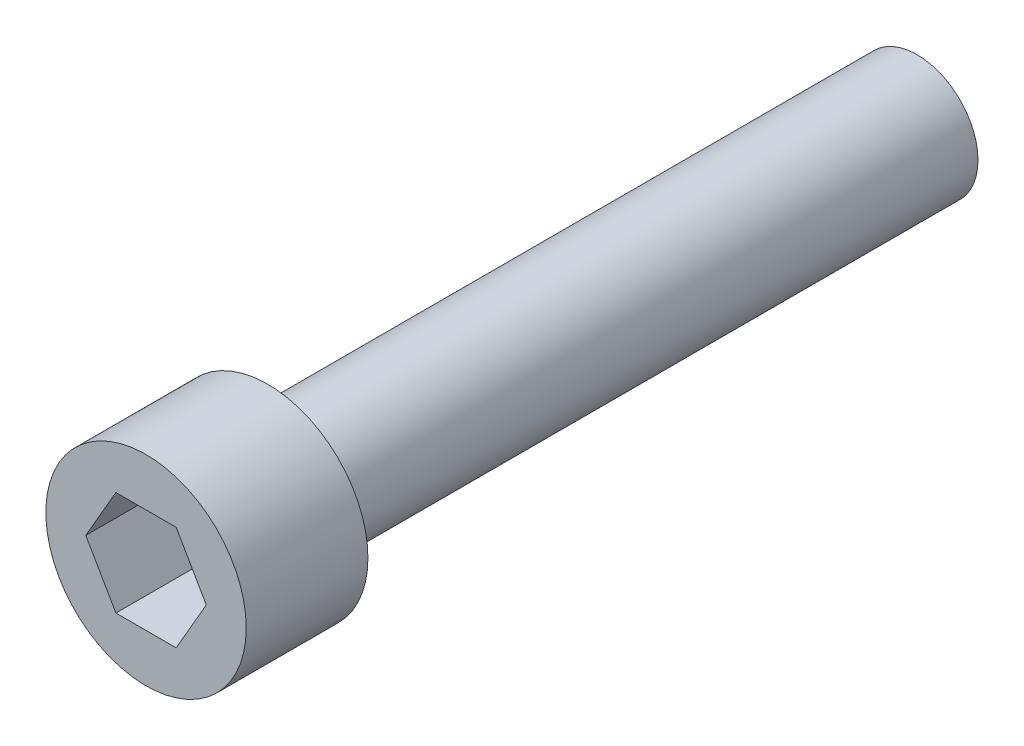
ISO-10303-21;
HEADER;
FILE_DESCRIPTION(('STEP AP214'),'2;1');
FILE_NAME('part.step','',(''),(''),'','','');
FILE_SCHEMA(('AUTOMOTIVE_DESIGN { 1 0 10303 214 1 1 1 1 }'));
ENDSEC;
DATA;
#1=APPLICATION_CONTEXT('core data for automotive mechanical design processes');
#2=APPLICATION_PROTOCOL_DEFINITION('international standard','automotive_design',2000,#1);
#3=PRODUCT_CONTEXT('',#1,'mechanical');
#4=PRODUCT('Part','Part','',(#3));
#5=PRODUCT_RELATED_PRODUCT_CATEGORY('part','',(#4));
#6=PRODUCT_DEFINITION_FORMATION('','',#4);
#7=PRODUCT_DEFINITION_CONTEXT('part definition',#1,'design');
#8=PRODUCT_DEFINITION('design','',#6,#7);
#9=PRODUCT_DEFINITION_SHAPE('','',#8);
#10=(LENGTH_UNIT() NAMED_UNIT(*) SI_UNIT(.MILLI.,.METRE.));
#11=(NAMED_UNIT(*) PLANE_ANGLE_UNIT() SI_UNIT($,.RADIAN.));
#12=(NAMED_UNIT(*) SI_UNIT($,.STERADIAN.) SOLID_ANGLE_UNIT());
#13=UNCERTAINTY_MEASURE_WITH_UNIT(LENGTH_MEASURE(1.E-05),#10,'distance_accuracy_value','');
#14=(GEOMETRIC_REPRESENTATION_CONTEXT(3) GLOBAL_UNCERTAINTY_ASSIGNED_CONTEXT((#13)) GLOBAL_UNIT_ASSIGNED_CONTEXT((#10,
#11,#12)) REPRESENTATION_CONTEXT('',''));
#15=CARTESIAN_POINT('',(0.,0.,0.));
#16=DIRECTION('',(0.,0.,1.));
#17=DIRECTION('',(1.,0.,0.));
#18=AXIS2_PLACEMENT_3D('',#15,#16,#17);
#19=CARTESIAN_POINT('',(3.42900000000001,0.,0.));
#20=DIRECTION('',(0.,0.,1.));
#21=DIRECTION('',(1.,0.,0.));
#22=AXIS2_PLACEMENT_3D('',#19,#20,#21);
#23=PLANE('',#22);
#24=DIRECTION('',(0.5,0.866025403784439,0.));
#25=VECTOR('',#24,1.);
#26=CARTESIAN_POINT('',(1.03111149638085,-1.7859375,0.));
#27=LINE('',#26,#25);
#28=CARTESIAN_POINT('',(1.03111149638085,-1.7859375,0.));
#29=VERTEX_POINT('',#28);
#30=CARTESIAN_POINT('',(2.06222299276169,0.,0.));
#31=VERTEX_POINT('',#30);
#32=EDGE_CURVE('E46',#29,#31,#27,.T.);
#33=ORIENTED_EDGE('',*,*,#32,.F.);
#34=DIRECTION('',(1.,0.,0.));
#35=VECTOR('',#34,1.);
#36=CARTESIAN_POINT('',(-1.03111149638085,-1.7859375,0.));
#37=LINE('',#36,#35);
#38=CARTESIAN_POINT('',(-1.03111149638085,-1.7859375,0.));
#39=VERTEX_POINT('',#38);
#40=EDGE_CURVE('E129',#39,#29,#37,.T.);
#41=ORIENTED_EDGE('',*,*,#40,.F.);
#42=DIRECTION('',(0.5,-0.866025403784439,0.));
#43=VECTOR('',#42,1.);
#44=CARTESIAN_POINT('',(-2.06222299276169,0.,0.));
#45=LINE('',#44,#43);
#46=CARTESIAN_POINT('',(-2.06222299276169,0.,0.));
#47=VERTEX_POINT('',#46);
#48=EDGE_CURVE('E127',#47,#39,#45,.T.);
#49=ORIENTED_EDGE('',*,*,#48,.F.);
#50=DIRECTION('',(-0.5,-0.866025403784439,0.));
#51=VECTOR('',#50,1.);
#52=CARTESIAN_POINT('',(-1.03111149638085,1.7859375,0.));
#53=LINE('',#52,#51);
#54=CARTESIAN_POINT('',(-1.03111149638085,1.7859375,0.));
#55=VERTEX_POINT('',#54);
#56=EDGE_CURVE('E94',#55,#47,#53,.T.);
#57=ORIENTED_EDGE('',*,*,#56,.F.);
#58=DIRECTION('',(-1.,0.,0.));
#59=VECTOR('',#58,1.);
#60=CARTESIAN_POINT('',(1.03111149638085,1.7859375,0.));
#61=LINE('',#60,#59);
#62=CARTESIAN_POINT('',(1.03111149638085,1.7859375,0.));
#63=VERTEX_POINT('',#62);
#64=EDGE_CURVE('E123',#63,#55,#61,.T.);
#65=ORIENTED_EDGE('',*,*,#64,.F.);
#66=DIRECTION('',(-0.5,0.866025403784438,0.));
#67=VECTOR('',#66,1.);
#68=CARTESIAN_POINT('',(2.06222299276169,0.,0.));
#69=LINE('',#68,#67);
#70=EDGE_CURVE('E120',#31,#63,#69,.T.);
#71=ORIENTED_EDGE('',*,*,#70,.F.);
#72=EDGE_LOOP('',(#33,#41,#49,#57,#65,#71));
#73=FACE_BOUND('',#72,.T.);
#74=CARTESIAN_POINT('',(0.,0.,0.));
#75=DIRECTION('',(0.,0.,1.));
#76=DIRECTION('',(1.,0.,0.));
#77=AXIS2_PLACEMENT_3D('',#74,#75,#76);
#78=CIRCLE('',#77,3.42900000000001);
#79=CARTESIAN_POINT('',(3.42900000000001,0.,0.));
#80=VERTEX_POINT('',#79);
#81=EDGE_CURVE('E133',#80,#80,#78,.T.);
#82=ORIENTED_EDGE('',*,*,#81,.T.);
#83=EDGE_LOOP('',(#82));
#84=FACE_BOUND('',#83,.T.);
#85=ADVANCED_FACE('F32',(#73,#84),#23,.T.);
#86=CARTESIAN_POINT('',(0.,0.,-26.3906));
#87=DIRECTION('',(0.,0.,-1.));
#88=DIRECTION('',(-1.,0.,0.));
#89=AXIS2_PLACEMENT_3D('',#86,#87,#88);
#90=PLANE('',#89);
#91=CARTESIAN_POINT('',(0.,0.,-26.3906));
#92=DIRECTION('',(0.,0.,1.));
#93=DIRECTION('',(1.,0.,0.));
#94=AXIS2_PLACEMENT_3D('',#91,#92,#93);
#95=CIRCLE('',#94,2.0828);
#96=CARTESIAN_POINT('',(2.08280000000001,0.,-26.3906));
#97=VERTEX_POINT('',#96);
#98=EDGE_CURVE('E11',#97,#97,#95,.T.);
#99=ORIENTED_EDGE('',*,*,#98,.F.);
#100=EDGE_LOOP('',(#99));
#101=FACE_BOUND('',#100,.T.);
#102=ADVANCED_FACE('F151',(#101),#90,.T.);
#103=CARTESIAN_POINT('',(0.,0.,0.));
#104=DIRECTION('',(0.,0.,1.));
#105=DIRECTION('',(1.,0.,0.));
#106=AXIS2_PLACEMENT_3D('',#103,#104,#105);
#107=CYLINDRICAL_SURFACE('',#106,2.0828);
#108=ORIENTED_EDGE('',*,*,#98,.T.);
#109=EDGE_LOOP('',(#108));
#110=FACE_BOUND('',#109,.T.);
#111=CARTESIAN_POINT('',(0.,0.,-4.1656));
#112=DIRECTION('',(0.,0.,1.));
#113=DIRECTION('',(1.,0.,0.));
#114=AXIS2_PLACEMENT_3D('',#111,#112,#113);
#115=CIRCLE('',#114,2.08280000000001);
#116=CARTESIAN_POINT('',(2.08280000000001,0.,-4.1656));
#117=VERTEX_POINT('',#116);
#118=EDGE_CURVE('E39',#117,#117,#115,.T.);
#119=ORIENTED_EDGE('',*,*,#118,.F.);
#120=EDGE_LOOP('',(#119));
#121=FACE_BOUND('',#120,.T.);
#122=ADVANCED_FACE('F149',(#110,#121),#107,.T.);
#123=CARTESIAN_POINT('',(2.08280000000001,0.,-4.1656));
#124=DIRECTION('',(0.,0.,-1.));
#125=DIRECTION('',(-1.,0.,0.));
#126=AXIS2_PLACEMENT_3D('',#123,#124,#125);
#127=PLANE('',#126);
#128=ORIENTED_EDGE('',*,*,#118,.T.);
#129=EDGE_LOOP('',(#128));
#130=FACE_BOUND('',#129,.T.);
#131=CARTESIAN_POINT('',(0.,0.,-4.1656));
#132=DIRECTION('',(0.,0.,1.));
#133=DIRECTION('',(1.,0.,0.));
#134=AXIS2_PLACEMENT_3D('',#131,#132,#133);
#135=CIRCLE('',#134,3.429);
#136=CARTESIAN_POINT('',(3.429,0.,-4.1656));
#137=VERTEX_POINT('',#136);
#138=EDGE_CURVE('E141',#137,#137,#135,.T.);
#139=ORIENTED_EDGE('',*,*,#138,.F.);
#140=EDGE_LOOP('',(#139));
#141=FACE_BOUND('',#140,.T.);
#142=ADVANCED_FACE('F146',(#130,#141),#127,.T.);
#143=CARTESIAN_POINT('',(0.,0.,0.));
#144=DIRECTION('',(0.,0.,1.));
#145=DIRECTION('',(1.,0.,0.));
#146=AXIS2_PLACEMENT_3D('',#143,#144,#145);
#147=CYLINDRICAL_SURFACE('',#146,3.429);
#148=ORIENTED_EDGE('',*,*,#138,.T.);
#149=EDGE_LOOP('',(#148));
#150=FACE_BOUND('',#149,.T.);
#151=ORIENTED_EDGE('',*,*,#81,.F.);
#152=EDGE_LOOP('',(#151));
#153=FACE_BOUND('',#152,.T.);
#154=ADVANCED_FACE('F158',(#150,#153),#147,.T.);
#155=CARTESIAN_POINT('',(1.03111149638085,-1.7859375,-3.175));
#156=DIRECTION('',(0.866025403784439,-0.5,0.));
#157=DIRECTION('',(0.5,0.866025403784439,0.));
#158=AXIS2_PLACEMENT_3D('',#155,#156,#157);
#159=PLANE('',#158);
#160=ORIENTED_EDGE('',*,*,#32,.T.);
#161=DIRECTION('',(0.,0.,1.));
#162=VECTOR('',#161,1.);
#163=CARTESIAN_POINT('',(2.06222299276169,0.,-3.175));
#164=LINE('',#163,#162);
#165=CARTESIAN_POINT('',(2.06222299276169,0.,-3.175));
#166=VERTEX_POINT('',#165);
#167=EDGE_CURVE('E76',#166,#31,#164,.T.);
#168=ORIENTED_EDGE('',*,*,#167,.F.);
#169=DIRECTION('',(0.5,0.866025403784439,0.));
#170=VECTOR('',#169,1.);
#171=CARTESIAN_POINT('',(1.03111149638085,-1.7859375,-3.175));
#172=LINE('',#171,#170);
#173=CARTESIAN_POINT('',(1.03111149638085,-1.7859375,-3.175));
#174=VERTEX_POINT('',#173);
#175=EDGE_CURVE('E131',#174,#166,#172,.T.);
#176=ORIENTED_EDGE('',*,*,#175,.F.);
#177=DIRECTION('',(0.,0.,1.));
#178=VECTOR('',#177,1.);
#179=CARTESIAN_POINT('',(1.03111149638085,-1.7859375,-3.175));
#180=LINE('',#179,#178);
#181=EDGE_CURVE('E54',#174,#29,#180,.T.);
#182=ORIENTED_EDGE('',*,*,#181,.T.);
#183=EDGE_LOOP('',(#160,#168,#176,#182));
#184=FACE_BOUND('',#183,.T.);
#185=ADVANCED_FACE('F171',(#184),#159,.F.);
#186=CARTESIAN_POINT('',(-1.03111149638085,-1.7859375,-3.175));
#187=DIRECTION('',(0.,-1.,0.));
#188=DIRECTION('',(1.,0.,0.));
#189=AXIS2_PLACEMENT_3D('',#186,#187,#188);
#190=PLANE('',#189);
#191=ORIENTED_EDGE('',*,*,#40,.T.);
#192=ORIENTED_EDGE('',*,*,#181,.F.);
#193=DIRECTION('',(1.,0.,0.));
#194=VECTOR('',#193,1.);
#195=CARTESIAN_POINT('',(-1.03111149638085,-1.7859375,-3.175));
#196=LINE('',#195,#194);
#197=CARTESIAN_POINT('',(-1.03111149638085,-1.7859375,-3.175));
#198=VERTEX_POINT('',#197);
#199=EDGE_CURVE('E106',#198,#174,#196,.T.);
#200=ORIENTED_EDGE('',*,*,#199,.F.);
#201=DIRECTION('',(0.,0.,1.));
#202=VECTOR('',#201,1.);
#203=CARTESIAN_POINT('',(-1.03111149638085,-1.7859375,-3.175));
#204=LINE('',#203,#202);
#205=EDGE_CURVE('E98',#198,#39,#204,.T.);
#206=ORIENTED_EDGE('',*,*,#205,.T.);
#207=EDGE_LOOP('',(#191,#192,#200,#206));
#208=FACE_BOUND('',#207,.T.);
#209=ADVANCED_FACE('F177',(#208),#190,.F.);
#210=CARTESIAN_POINT('',(-2.06222299276169,0.,-3.175));
#211=DIRECTION('',(-0.866025403784439,-0.5,0.));
#212=DIRECTION('',(0.5,-0.866025403784439,0.));
#213=AXIS2_PLACEMENT_3D('',#210,#211,#212);
#214=PLANE('',#213);
#215=ORIENTED_EDGE('',*,*,#48,.T.);
#216=ORIENTED_EDGE('',*,*,#205,.F.);
#217=DIRECTION('',(0.5,-0.866025403784439,0.));
#218=VECTOR('',#217,1.);
#219=CARTESIAN_POINT('',(-2.06222299276169,0.,-3.175));
#220=LINE('',#219,#218);
#221=CARTESIAN_POINT('',(-2.06222299276169,0.,-3.175));
#222=VERTEX_POINT('',#221);
#223=EDGE_CURVE('E102',#222,#198,#220,.T.);
#224=ORIENTED_EDGE('',*,*,#223,.F.);
#225=DIRECTION('',(0.,0.,1.));
#226=VECTOR('',#225,1.);
#227=CARTESIAN_POINT('',(-2.06222299276169,0.,-3.175));
#228=LINE('',#227,#226);
#229=EDGE_CURVE('E87',#222,#47,#228,.T.);
#230=ORIENTED_EDGE('',*,*,#229,.T.);
#231=EDGE_LOOP('',(#215,#216,#224,#230));
#232=FACE_BOUND('',#231,.T.);
#233=ADVANCED_FACE('F103',(#232),#214,.F.);
#234=CARTESIAN_POINT('',(-1.03111149638085,1.7859375,-3.175));
#235=DIRECTION('',(-0.866025403784439,0.5,0.));
#236=DIRECTION('',(-0.5,-0.866025403784439,0.));
#237=AXIS2_PLACEMENT_3D('',#234,#235,#236);
#238=PLANE('',#237);
#239=ORIENTED_EDGE('',*,*,#56,.T.);
#240=ORIENTED_EDGE('',*,*,#229,.F.);
#241=DIRECTION('',(-0.5,-0.866025403784439,0.));
#242=VECTOR('',#241,1.);
#243=CARTESIAN_POINT('',(-1.03111149638085,1.7859375,-3.175));
#244=LINE('',#243,#242);
#245=CARTESIAN_POINT('',(-1.03111149638085,1.7859375,-3.175));
#246=VERTEX_POINT('',#245);
#247=EDGE_CURVE('E91',#246,#222,#244,.T.);
#248=ORIENTED_EDGE('',*,*,#247,.F.);
#249=DIRECTION('',(0.,0.,1.));
#250=VECTOR('',#249,1.);
#251=CARTESIAN_POINT('',(-1.03111149638085,1.7859375,-3.175));
#252=LINE('',#251,#250);
#253=EDGE_CURVE('E99',#246,#55,#252,.T.);
#254=ORIENTED_EDGE('',*,*,#253,.T.);
#255=EDGE_LOOP('',(#239,#240,#248,#254));
#256=FACE_BOUND('',#255,.T.);
#257=ADVANCED_FACE('F89',(#256),#238,.F.);
#258=CARTESIAN_POINT('',(1.03111149638085,1.7859375,-3.175));
#259=DIRECTION('',(0.,1.,0.));
#260=DIRECTION('',(0.,0.,1.));
#261=AXIS2_PLACEMENT_3D('',#258,#259,#260);
#262=PLANE('',#261);
#263=ORIENTED_EDGE('',*,*,#64,.T.);
#264=ORIENTED_EDGE('',*,*,#253,.F.);
#265=DIRECTION('',(-1.,0.,0.));
#266=VECTOR('',#265,1.);
#267=CARTESIAN_POINT('',(1.03111149638085,1.7859375,-3.175));
#268=LINE('',#267,#266);
#269=CARTESIAN_POINT('',(1.03111149638085,1.7859375,-3.175));
#270=VERTEX_POINT('',#269);
#271=EDGE_CURVE('E112',#270,#246,#268,.T.);
#272=ORIENTED_EDGE('',*,*,#271,.F.);
#273=DIRECTION('',(0.,0.,1.));
#274=VECTOR('',#273,1.);
#275=CARTESIAN_POINT('',(1.03111149638085,1.7859375,-3.175));
#276=LINE('',#275,#274);
#277=EDGE_CURVE('E136',#270,#63,#276,.T.);
#278=ORIENTED_EDGE('',*,*,#277,.T.);
#279=EDGE_LOOP('',(#263,#264,#272,#278));
#280=FACE_BOUND('',#279,.T.);
#281=ADVANCED_FACE('F183',(#280),#262,.F.);
#282=CARTESIAN_POINT('',(2.06222299276169,0.,-3.175));
#283=DIRECTION('',(0.866025403784438,0.5,0.));
#284=DIRECTION('',(-0.5,0.866025403784439,0.));
#285=AXIS2_PLACEMENT_3D('',#282,#283,#284);
#286=PLANE('',#285);
#287=ORIENTED_EDGE('',*,*,#70,.T.);
#288=ORIENTED_EDGE('',*,*,#277,.F.);
#289=DIRECTION('',(-0.5,0.866025403784438,0.));
#290=VECTOR('',#289,1.);
#291=CARTESIAN_POINT('',(2.06222299276169,0.,-3.175));
#292=LINE('',#291,#290);
#293=EDGE_CURVE('E114',#166,#270,#292,.T.);
#294=ORIENTED_EDGE('',*,*,#293,.F.);
#295=ORIENTED_EDGE('',*,*,#167,.T.);
#296=EDGE_LOOP('',(#287,#288,#294,#295));
#297=FACE_BOUND('',#296,.T.);
#298=ADVANCED_FACE('F180',(#297),#286,.F.);
#299=CARTESIAN_POINT('',(0.,0.,-3.175));
#300=DIRECTION('',(0.,0.,1.));
#301=DIRECTION('',(1.,0.,0.));
#302=AXIS2_PLACEMENT_3D('',#299,#300,#301);
#303=PLANE('',#302);
#304=ORIENTED_EDGE('',*,*,#175,.T.);
#305=ORIENTED_EDGE('',*,*,#293,.T.);
#306=ORIENTED_EDGE('',*,*,#271,.T.);
#307=ORIENTED_EDGE('',*,*,#247,.T.);
#308=ORIENTED_EDGE('',*,*,#223,.T.);
#309=ORIENTED_EDGE('',*,*,#199,.T.);
#310=EDGE_LOOP('',(#304,#305,#306,#307,#308,#309));
#311=FACE_BOUND('',#310,.T.);
#312=ADVANCED_FACE('F109',(#311),#303,.T.);
#313=CLOSED_SHELL('',(#85,#102,#122,#142,#154,#185,#209,#233,#257,#281,#298,#312));
#314=MANIFOLD_SOLID_BREP('B2',#313);
#315=ADVANCED_BREP_SHAPE_REPRESENTATION('',(#18,#314),#14);
#316=SHAPE_DEFINITION_REPRESENTATION(#9,#315);
ENDSEC;
END-ISO-10303-21;
